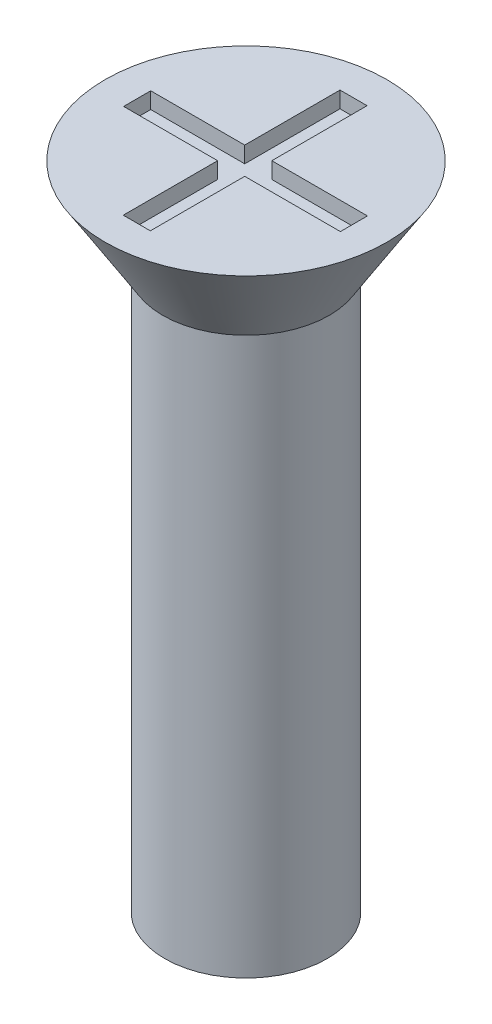
ISO-10303-21;
HEADER;
FILE_DESCRIPTION(('STEP AP214'),'2;1');
FILE_NAME('part.step','',(''),(''),'','','');
FILE_SCHEMA(('AUTOMOTIVE_DESIGN { 1 0 10303 214 1 1 1 1 }'));
ENDSEC;
DATA;
#1=APPLICATION_CONTEXT('core data for automotive mechanical design processes');
#2=APPLICATION_PROTOCOL_DEFINITION('international standard','automotive_design',2000,#1);
#3=PRODUCT_CONTEXT('',#1,'mechanical');
#4=PRODUCT('Part','Part','',(#3));
#5=PRODUCT_RELATED_PRODUCT_CATEGORY('part','',(#4));
#6=PRODUCT_DEFINITION_FORMATION('','',#4);
#7=PRODUCT_DEFINITION_CONTEXT('part definition',#1,'design');
#8=PRODUCT_DEFINITION('design','',#6,#7);
#9=PRODUCT_DEFINITION_SHAPE('','',#8);
#10=(LENGTH_UNIT() NAMED_UNIT(*) SI_UNIT(.MILLI.,.METRE.));
#11=(NAMED_UNIT(*) PLANE_ANGLE_UNIT() SI_UNIT($,.RADIAN.));
#12=(NAMED_UNIT(*) SI_UNIT($,.STERADIAN.) SOLID_ANGLE_UNIT());
#13=UNCERTAINTY_MEASURE_WITH_UNIT(LENGTH_MEASURE(1.E-05),#10,'distance_accuracy_value','');
#14=(GEOMETRIC_REPRESENTATION_CONTEXT(3) GLOBAL_UNCERTAINTY_ASSIGNED_CONTEXT((#13)) GLOBAL_UNIT_ASSIGNED_CONTEXT((#10,
#11,#12)) REPRESENTATION_CONTEXT('',''));
#15=CARTESIAN_POINT('',(0.,0.,0.));
#16=DIRECTION('',(0.,0.,1.));
#17=DIRECTION('',(1.,0.,0.));
#18=AXIS2_PLACEMENT_3D('',#15,#16,#17);
#19=CARTESIAN_POINT('',(0.,12.,0.));
#20=DIRECTION('',(0.,1.,0.));
#21=DIRECTION('',(0.,0.,1.));
#22=AXIS2_PLACEMENT_3D('',#19,#20,#21);
#23=PLANE('',#22);
#24=CARTESIAN_POINT('',(0.,12.,0.));
#25=DIRECTION('',(0.,1.,0.));
#26=DIRECTION('',(0.,0.,1.));
#27=AXIS2_PLACEMENT_3D('',#24,#25,#26);
#28=CIRCLE('',#27,2.6);
#29=CARTESIAN_POINT('',(0.,12.,2.6));
#30=VERTEX_POINT('',#29);
#31=EDGE_CURVE('E192',#30,#30,#28,.T.);
#32=ORIENTED_EDGE('',*,*,#31,.T.);
#33=EDGE_LOOP('',(#32));
#34=FACE_BOUND('',#33,.T.);
#35=DIRECTION('',(1.,0.,0.));
#36=VECTOR('',#35,1.);
#37=CARTESIAN_POINT('',(0.,12.,-2.));
#38=LINE('',#37,#36);
#39=CARTESIAN_POINT('',(-0.265272843023468,12.,-2.));
#40=VERTEX_POINT('',#39);
#41=CARTESIAN_POINT('',(0.234727156976532,12.,-2.));
#42=VERTEX_POINT('',#41);
#43=EDGE_CURVE('E161',#40,#42,#38,.T.);
#44=ORIENTED_EDGE('',*,*,#43,.T.);
#45=DIRECTION('',(0.,0.,1.));
#46=VECTOR('',#45,1.);
#47=CARTESIAN_POINT('',(0.234727156976532,12.,0.));
#48=LINE('',#47,#46);
#49=CARTESIAN_POINT('',(0.234727156976532,12.,-0.241621514992573));
#50=VERTEX_POINT('',#49);
#51=EDGE_CURVE('E48',#42,#50,#48,.T.);
#52=ORIENTED_EDGE('',*,*,#51,.T.);
#53=DIRECTION('',(1.,0.,0.));
#54=VECTOR('',#53,1.);
#55=CARTESIAN_POINT('',(0.,12.,-0.241621514992573));
#56=LINE('',#55,#54);
#57=CARTESIAN_POINT('',(2.,12.,-0.241621514992573));
#58=VERTEX_POINT('',#57);
#59=EDGE_CURVE('E98',#50,#58,#56,.T.);
#60=ORIENTED_EDGE('',*,*,#59,.T.);
#61=DIRECTION('',(0.,0.,1.));
#62=VECTOR('',#61,1.);
#63=CARTESIAN_POINT('',(2.,12.,0.));
#64=LINE('',#63,#62);
#65=CARTESIAN_POINT('',(2.,12.,0.258378485007427));
#66=VERTEX_POINT('',#65);
#67=EDGE_CURVE('E186',#58,#66,#64,.T.);
#68=ORIENTED_EDGE('',*,*,#67,.T.);
#69=DIRECTION('',(1.,0.,0.));
#70=VECTOR('',#69,1.);
#71=CARTESIAN_POINT('',(0.,12.,0.258378485007427));
#72=LINE('',#71,#70);
#73=CARTESIAN_POINT('',(0.234727156976532,12.,0.258378485007427));
#74=VERTEX_POINT('',#73);
#75=EDGE_CURVE('E145',#74,#66,#72,.T.);
#76=ORIENTED_EDGE('',*,*,#75,.F.);
#77=DIRECTION('',(0.,0.,1.));
#78=VECTOR('',#77,1.);
#79=CARTESIAN_POINT('',(0.234727156976532,12.,0.));
#80=LINE('',#79,#78);
#81=CARTESIAN_POINT('',(0.234727156976533,12.,2.));
#82=VERTEX_POINT('',#81);
#83=EDGE_CURVE('E182',#74,#82,#80,.T.);
#84=ORIENTED_EDGE('',*,*,#83,.T.);
#85=DIRECTION('',(1.,0.,0.));
#86=VECTOR('',#85,1.);
#87=CARTESIAN_POINT('',(0.,12.,2.));
#88=LINE('',#87,#86);
#89=CARTESIAN_POINT('',(-0.265272843023467,12.,2.));
#90=VERTEX_POINT('',#89);
#91=EDGE_CURVE('E179',#90,#82,#88,.T.);
#92=ORIENTED_EDGE('',*,*,#91,.F.);
#93=DIRECTION('',(0.,0.,1.));
#94=VECTOR('',#93,1.);
#95=CARTESIAN_POINT('',(-0.265272843023468,12.,0.));
#96=LINE('',#95,#94);
#97=CARTESIAN_POINT('',(-0.265272843023468,12.,0.258378485007427));
#98=VERTEX_POINT('',#97);
#99=EDGE_CURVE('E176',#98,#90,#96,.T.);
#100=ORIENTED_EDGE('',*,*,#99,.F.);
#101=DIRECTION('',(1.,0.,0.));
#102=VECTOR('',#101,1.);
#103=CARTESIAN_POINT('',(0.,12.,0.258378485007427));
#104=LINE('',#103,#102);
#105=CARTESIAN_POINT('',(-2.,12.,0.258378485007427));
#106=VERTEX_POINT('',#105);
#107=EDGE_CURVE('E173',#106,#98,#104,.T.);
#108=ORIENTED_EDGE('',*,*,#107,.F.);
#109=DIRECTION('',(0.,0.,1.));
#110=VECTOR('',#109,1.);
#111=CARTESIAN_POINT('',(-2.,12.,0.));
#112=LINE('',#111,#110);
#113=CARTESIAN_POINT('',(-2.,12.,-0.241621514992573));
#114=VERTEX_POINT('',#113);
#115=EDGE_CURVE('E170',#114,#106,#112,.T.);
#116=ORIENTED_EDGE('',*,*,#115,.F.);
#117=DIRECTION('',(1.,0.,0.));
#118=VECTOR('',#117,1.);
#119=CARTESIAN_POINT('',(0.,12.,-0.241621514992573));
#120=LINE('',#119,#118);
#121=CARTESIAN_POINT('',(-0.265272843023468,12.,-0.241621514992573));
#122=VERTEX_POINT('',#121);
#123=EDGE_CURVE('E167',#114,#122,#120,.T.);
#124=ORIENTED_EDGE('',*,*,#123,.T.);
#125=DIRECTION('',(0.,0.,1.));
#126=VECTOR('',#125,1.);
#127=CARTESIAN_POINT('',(-0.265272843023468,12.,0.));
#128=LINE('',#127,#126);
#129=EDGE_CURVE('E164',#40,#122,#128,.T.);
#130=ORIENTED_EDGE('',*,*,#129,.F.);
#131=EDGE_LOOP('',(#44,#52,#60,#68,#76,#84,#92,#100,#108,#116,#124,#130));
#132=FACE_BOUND('',#131,.T.);
#133=ADVANCED_FACE('F33',(#34,#132),#23,.T.);
#134=CARTESIAN_POINT('',(0.,12.,0.));
#135=DIRECTION('',(0.,-1.,0.));
#136=DIRECTION('',(0.,0.,-1.));
#137=AXIS2_PLACEMENT_3D('',#134,#135,#136);
#138=CYLINDRICAL_SURFACE('',#137,1.5);
#139=CARTESIAN_POINT('',(0.,0.,0.));
#140=DIRECTION('',(0.,1.,0.));
#141=DIRECTION('',(0.,0.,1.));
#142=AXIS2_PLACEMENT_3D('',#139,#140,#141);
#143=CIRCLE('',#142,1.5);
#144=CARTESIAN_POINT('',(0.,0.,1.5));
#145=VERTEX_POINT('',#144);
#146=EDGE_CURVE('E41',#145,#145,#143,.T.);
#147=ORIENTED_EDGE('',*,*,#146,.T.);
#148=EDGE_LOOP('',(#147));
#149=FACE_BOUND('',#148,.T.);
#150=CARTESIAN_POINT('',(0.,10.3,0.));
#151=DIRECTION('',(0.,1.,0.));
#152=DIRECTION('',(0.,0.,1.));
#153=AXIS2_PLACEMENT_3D('',#150,#151,#152);
#154=CIRCLE('',#153,1.5);
#155=CARTESIAN_POINT('',(0.,10.3,1.5));
#156=VERTEX_POINT('',#155);
#157=EDGE_CURVE('E11',#156,#156,#154,.T.);
#158=ORIENTED_EDGE('',*,*,#157,.F.);
#159=EDGE_LOOP('',(#158));
#160=FACE_BOUND('',#159,.T.);
#161=ADVANCED_FACE('F35',(#149,#160),#138,.T.);
#162=CARTESIAN_POINT('',(0.,0.,0.));
#163=DIRECTION('',(0.,1.,0.));
#164=DIRECTION('',(0.,0.,1.));
#165=AXIS2_PLACEMENT_3D('',#162,#163,#164);
#166=PLANE('',#165);
#167=ORIENTED_EDGE('',*,*,#146,.F.);
#168=EDGE_LOOP('',(#167));
#169=FACE_BOUND('',#168,.T.);
#170=ADVANCED_FACE('F219',(#169),#166,.F.);
#171=CARTESIAN_POINT('',(0.,12.,0.));
#172=DIRECTION('',(0.,1.,0.));
#173=DIRECTION('',(0.,0.,1.));
#174=AXIS2_PLACEMENT_3D('',#171,#172,#173);
#175=CONICAL_SURFACE('',#174,2.6,0.558505360638187);
#176=CARTESIAN_POINT('',(0.,10.3,0.));
#177=DIRECTION('',(0.,1.,0.));
#178=DIRECTION('',(0.,0.,1.));
#179=AXIS2_PLACEMENT_3D('',#176,#177,#178);
#180=CIRCLE('',#179,1.53772210175414);
#181=CARTESIAN_POINT('',(0.,10.3,1.53772210175414));
#182=VERTEX_POINT('',#181);
#183=EDGE_CURVE('E212',#182,#182,#180,.T.);
#184=ORIENTED_EDGE('',*,*,#183,.T.);
#185=EDGE_LOOP('',(#184));
#186=FACE_BOUND('',#185,.T.);
#187=ORIENTED_EDGE('',*,*,#31,.F.);
#188=EDGE_LOOP('',(#187));
#189=FACE_BOUND('',#188,.T.);
#190=ADVANCED_FACE('F221',(#186,#189),#175,.T.);
#191=CARTESIAN_POINT('',(0.,10.3,0.));
#192=DIRECTION('',(0.,1.,0.));
#193=DIRECTION('',(0.,0.,1.));
#194=AXIS2_PLACEMENT_3D('',#191,#192,#193);
#195=PLANE('',#194);
#196=ORIENTED_EDGE('',*,*,#157,.T.);
#197=EDGE_LOOP('',(#196));
#198=FACE_BOUND('',#197,.T.);
#199=ORIENTED_EDGE('',*,*,#183,.F.);
#200=EDGE_LOOP('',(#199));
#201=FACE_BOUND('',#200,.T.);
#202=ADVANCED_FACE('F226',(#198,#201),#195,.F.);
#203=CARTESIAN_POINT('',(0.234727156976532,11.7,0.));
#204=DIRECTION('',(-1.,0.,0.));
#205=DIRECTION('',(0.,0.,1.));
#206=AXIS2_PLACEMENT_3D('',#203,#204,#205);
#207=PLANE('',#206);
#208=ORIENTED_EDGE('',*,*,#51,.F.);
#209=DIRECTION('',(0.,1.,0.));
#210=VECTOR('',#209,1.);
#211=CARTESIAN_POINT('',(0.234727156976532,11.7,-2.));
#212=LINE('',#211,#210);
#213=CARTESIAN_POINT('',(0.234727156976532,11.7,-2.));
#214=VERTEX_POINT('',#213);
#215=EDGE_CURVE('E159',#214,#42,#212,.T.);
#216=ORIENTED_EDGE('',*,*,#215,.F.);
#217=DIRECTION('',(0.,0.,1.));
#218=VECTOR('',#217,1.);
#219=CARTESIAN_POINT('',(0.234727156976532,11.7,0.));
#220=LINE('',#219,#218);
#221=CARTESIAN_POINT('',(0.234727156976532,11.7,-0.241621514992573));
#222=VERTEX_POINT('',#221);
#223=EDGE_CURVE('E189',#214,#222,#220,.T.);
#224=ORIENTED_EDGE('',*,*,#223,.T.);
#225=DIRECTION('',(0.,1.,0.));
#226=VECTOR('',#225,1.);
#227=CARTESIAN_POINT('',(0.234727156976532,11.7,-0.241621514992573));
#228=LINE('',#227,#226);
#229=EDGE_CURVE('E190',#222,#50,#228,.T.);
#230=ORIENTED_EDGE('',*,*,#229,.T.);
#231=EDGE_LOOP('',(#208,#216,#224,#230));
#232=FACE_BOUND('',#231,.T.);
#233=ADVANCED_FACE('F238',(#232),#207,.T.);
#234=CARTESIAN_POINT('',(0.,11.7,-0.241621514992573));
#235=DIRECTION('',(0.,0.,1.));
#236=DIRECTION('',(1.,0.,0.));
#237=AXIS2_PLACEMENT_3D('',#234,#235,#236);
#238=PLANE('',#237);
#239=ORIENTED_EDGE('',*,*,#59,.F.);
#240=ORIENTED_EDGE('',*,*,#229,.F.);
#241=DIRECTION('',(1.,0.,0.));
#242=VECTOR('',#241,1.);
#243=CARTESIAN_POINT('',(0.,11.7,-0.241621514992573));
#244=LINE('',#243,#242);
#245=CARTESIAN_POINT('',(2.,11.7,-0.241621514992573));
#246=VERTEX_POINT('',#245);
#247=EDGE_CURVE('E57',#222,#246,#244,.T.);
#248=ORIENTED_EDGE('',*,*,#247,.T.);
#249=DIRECTION('',(0.,1.,0.));
#250=VECTOR('',#249,1.);
#251=CARTESIAN_POINT('',(2.,11.7,-0.241621514992573));
#252=LINE('',#251,#250);
#253=EDGE_CURVE('E137',#246,#58,#252,.T.);
#254=ORIENTED_EDGE('',*,*,#253,.T.);
#255=EDGE_LOOP('',(#239,#240,#248,#254));
#256=FACE_BOUND('',#255,.T.);
#257=ADVANCED_FACE('F242',(#256),#238,.T.);
#258=CARTESIAN_POINT('',(2.,11.7,0.));
#259=DIRECTION('',(-1.,0.,0.));
#260=DIRECTION('',(0.,0.,1.));
#261=AXIS2_PLACEMENT_3D('',#258,#259,#260);
#262=PLANE('',#261);
#263=ORIENTED_EDGE('',*,*,#67,.F.);
#264=ORIENTED_EDGE('',*,*,#253,.F.);
#265=DIRECTION('',(0.,0.,1.));
#266=VECTOR('',#265,1.);
#267=CARTESIAN_POINT('',(2.,11.7,0.));
#268=LINE('',#267,#266);
#269=CARTESIAN_POINT('',(2.,11.7,0.258378485007427));
#270=VERTEX_POINT('',#269);
#271=EDGE_CURVE('E131',#246,#270,#268,.T.);
#272=ORIENTED_EDGE('',*,*,#271,.T.);
#273=DIRECTION('',(0.,1.,0.));
#274=VECTOR('',#273,1.);
#275=CARTESIAN_POINT('',(2.,11.7,0.258378485007427));
#276=LINE('',#275,#274);
#277=EDGE_CURVE('E135',#270,#66,#276,.T.);
#278=ORIENTED_EDGE('',*,*,#277,.T.);
#279=EDGE_LOOP('',(#263,#264,#272,#278));
#280=FACE_BOUND('',#279,.T.);
#281=ADVANCED_FACE('F134',(#280),#262,.T.);
#282=CARTESIAN_POINT('',(0.,11.7,0.258378485007427));
#283=DIRECTION('',(0.,0.,1.));
#284=DIRECTION('',(1.,0.,0.));
#285=AXIS2_PLACEMENT_3D('',#282,#283,#284);
#286=PLANE('',#285);
#287=ORIENTED_EDGE('',*,*,#75,.T.);
#288=ORIENTED_EDGE('',*,*,#277,.F.);
#289=DIRECTION('',(1.,0.,0.));
#290=VECTOR('',#289,1.);
#291=CARTESIAN_POINT('',(0.,11.7,0.258378485007427));
#292=LINE('',#291,#290);
#293=CARTESIAN_POINT('',(0.234727156976532,11.7,0.258378485007427));
#294=VERTEX_POINT('',#293);
#295=EDGE_CURVE('E139',#294,#270,#292,.T.);
#296=ORIENTED_EDGE('',*,*,#295,.F.);
#297=DIRECTION('',(0.,1.,0.));
#298=VECTOR('',#297,1.);
#299=CARTESIAN_POINT('',(0.234727156976532,11.7,0.258378485007427));
#300=LINE('',#299,#298);
#301=EDGE_CURVE('E147',#294,#74,#300,.T.);
#302=ORIENTED_EDGE('',*,*,#301,.T.);
#303=EDGE_LOOP('',(#287,#288,#296,#302));
#304=FACE_BOUND('',#303,.T.);
#305=ADVANCED_FACE('F143',(#304),#286,.F.);
#306=CARTESIAN_POINT('',(0.234727156976532,11.7,0.));
#307=DIRECTION('',(-1.,0.,0.));
#308=DIRECTION('',(0.,0.,1.));
#309=AXIS2_PLACEMENT_3D('',#306,#307,#308);
#310=PLANE('',#309);
#311=ORIENTED_EDGE('',*,*,#83,.F.);
#312=ORIENTED_EDGE('',*,*,#301,.F.);
#313=DIRECTION('',(0.,0.,1.));
#314=VECTOR('',#313,1.);
#315=CARTESIAN_POINT('',(0.234727156976532,11.7,0.));
#316=LINE('',#315,#314);
#317=CARTESIAN_POINT('',(0.234727156976533,11.7,2.));
#318=VERTEX_POINT('',#317);
#319=EDGE_CURVE('E152',#294,#318,#316,.T.);
#320=ORIENTED_EDGE('',*,*,#319,.T.);
#321=DIRECTION('',(0.,1.,0.));
#322=VECTOR('',#321,1.);
#323=CARTESIAN_POINT('',(0.234727156976533,11.7,2.));
#324=LINE('',#323,#322);
#325=EDGE_CURVE('E195',#318,#82,#324,.T.);
#326=ORIENTED_EDGE('',*,*,#325,.T.);
#327=EDGE_LOOP('',(#311,#312,#320,#326));
#328=FACE_BOUND('',#327,.T.);
#329=ADVANCED_FACE('F269',(#328),#310,.T.);
#330=CARTESIAN_POINT('',(0.,11.7,2.));
#331=DIRECTION('',(0.,0.,1.));
#332=DIRECTION('',(1.,0.,0.));
#333=AXIS2_PLACEMENT_3D('',#330,#331,#332);
#334=PLANE('',#333);
#335=ORIENTED_EDGE('',*,*,#91,.T.);
#336=ORIENTED_EDGE('',*,*,#325,.F.);
#337=DIRECTION('',(1.,0.,0.));
#338=VECTOR('',#337,1.);
#339=CARTESIAN_POINT('',(0.,11.7,2.));
#340=LINE('',#339,#338);
#341=CARTESIAN_POINT('',(-0.265272843023467,11.7,2.));
#342=VERTEX_POINT('',#341);
#343=EDGE_CURVE('E154',#342,#318,#340,.T.);
#344=ORIENTED_EDGE('',*,*,#343,.F.);
#345=DIRECTION('',(0.,1.,0.));
#346=VECTOR('',#345,1.);
#347=CARTESIAN_POINT('',(-0.265272843023467,11.7,2.));
#348=LINE('',#347,#346);
#349=EDGE_CURVE('E197',#342,#90,#348,.T.);
#350=ORIENTED_EDGE('',*,*,#349,.T.);
#351=EDGE_LOOP('',(#335,#336,#344,#350));
#352=FACE_BOUND('',#351,.T.);
#353=ADVANCED_FACE('F265',(#352),#334,.F.);
#354=CARTESIAN_POINT('',(-0.265272843023468,11.7,0.));
#355=DIRECTION('',(-1.,0.,0.));
#356=DIRECTION('',(0.,0.,1.));
#357=AXIS2_PLACEMENT_3D('',#354,#355,#356);
#358=PLANE('',#357);
#359=ORIENTED_EDGE('',*,*,#99,.T.);
#360=ORIENTED_EDGE('',*,*,#349,.F.);
#361=DIRECTION('',(0.,0.,1.));
#362=VECTOR('',#361,1.);
#363=CARTESIAN_POINT('',(-0.265272843023468,11.7,0.));
#364=LINE('',#363,#362);
#365=CARTESIAN_POINT('',(-0.265272843023468,11.7,0.258378485007427));
#366=VERTEX_POINT('',#365);
#367=EDGE_CURVE('E417',#366,#342,#364,.T.);
#368=ORIENTED_EDGE('',*,*,#367,.F.);
#369=DIRECTION('',(0.,1.,0.));
#370=VECTOR('',#369,1.);
#371=CARTESIAN_POINT('',(-0.265272843023468,11.7,0.258378485007427));
#372=LINE('',#371,#370);
#373=EDGE_CURVE('E199',#366,#98,#372,.T.);
#374=ORIENTED_EDGE('',*,*,#373,.T.);
#375=EDGE_LOOP('',(#359,#360,#368,#374));
#376=FACE_BOUND('',#375,.T.);
#377=ADVANCED_FACE('F261',(#376),#358,.F.);
#378=CARTESIAN_POINT('',(0.,11.7,0.258378485007427));
#379=DIRECTION('',(0.,0.,1.));
#380=DIRECTION('',(1.,0.,0.));
#381=AXIS2_PLACEMENT_3D('',#378,#379,#380);
#382=PLANE('',#381);
#383=ORIENTED_EDGE('',*,*,#107,.T.);
#384=ORIENTED_EDGE('',*,*,#373,.F.);
#385=DIRECTION('',(1.,0.,0.));
#386=VECTOR('',#385,1.);
#387=CARTESIAN_POINT('',(0.,11.7,0.258378485007427));
#388=LINE('',#387,#386);
#389=CARTESIAN_POINT('',(-2.,11.7,0.258378485007427));
#390=VERTEX_POINT('',#389);
#391=EDGE_CURVE('E414',#390,#366,#388,.T.);
#392=ORIENTED_EDGE('',*,*,#391,.F.);
#393=DIRECTION('',(0.,1.,0.));
#394=VECTOR('',#393,1.);
#395=CARTESIAN_POINT('',(-2.,11.7,0.258378485007427));
#396=LINE('',#395,#394);
#397=EDGE_CURVE('E201',#390,#106,#396,.T.);
#398=ORIENTED_EDGE('',*,*,#397,.T.);
#399=EDGE_LOOP('',(#383,#384,#392,#398));
#400=FACE_BOUND('',#399,.T.);
#401=ADVANCED_FACE('F257',(#400),#382,.F.);
#402=CARTESIAN_POINT('',(-2.,11.7,0.));
#403=DIRECTION('',(-1.,0.,0.));
#404=DIRECTION('',(0.,0.,1.));
#405=AXIS2_PLACEMENT_3D('',#402,#403,#404);
#406=PLANE('',#405);
#407=ORIENTED_EDGE('',*,*,#115,.T.);
#408=ORIENTED_EDGE('',*,*,#397,.F.);
#409=DIRECTION('',(0.,0.,1.));
#410=VECTOR('',#409,1.);
#411=CARTESIAN_POINT('',(-2.,11.7,0.));
#412=LINE('',#411,#410);
#413=CARTESIAN_POINT('',(-2.,11.7,-0.241621514992573));
#414=VERTEX_POINT('',#413);
#415=EDGE_CURVE('E411',#414,#390,#412,.T.);
#416=ORIENTED_EDGE('',*,*,#415,.F.);
#417=DIRECTION('',(0.,1.,0.));
#418=VECTOR('',#417,1.);
#419=CARTESIAN_POINT('',(-2.,11.7,-0.241621514992573));
#420=LINE('',#419,#418);
#421=EDGE_CURVE('E203',#414,#114,#420,.T.);
#422=ORIENTED_EDGE('',*,*,#421,.T.);
#423=EDGE_LOOP('',(#407,#408,#416,#422));
#424=FACE_BOUND('',#423,.T.);
#425=ADVANCED_FACE('F253',(#424),#406,.F.);
#426=CARTESIAN_POINT('',(0.,11.7,-0.241621514992573));
#427=DIRECTION('',(0.,0.,1.));
#428=DIRECTION('',(1.,0.,0.));
#429=AXIS2_PLACEMENT_3D('',#426,#427,#428);
#430=PLANE('',#429);
#431=ORIENTED_EDGE('',*,*,#123,.F.);
#432=ORIENTED_EDGE('',*,*,#421,.F.);
#433=DIRECTION('',(1.,0.,0.));
#434=VECTOR('',#433,1.);
#435=CARTESIAN_POINT('',(0.,11.7,-0.241621514992573));
#436=LINE('',#435,#434);
#437=CARTESIAN_POINT('',(-0.265272843023468,11.7,-0.241621514992573));
#438=VERTEX_POINT('',#437);
#439=EDGE_CURVE('E409',#414,#438,#436,.T.);
#440=ORIENTED_EDGE('',*,*,#439,.T.);
#441=DIRECTION('',(0.,1.,0.));
#442=VECTOR('',#441,1.);
#443=CARTESIAN_POINT('',(-0.265272843023468,11.7,-0.241621514992573));
#444=LINE('',#443,#442);
#445=EDGE_CURVE('E205',#438,#122,#444,.T.);
#446=ORIENTED_EDGE('',*,*,#445,.T.);
#447=EDGE_LOOP('',(#431,#432,#440,#446));
#448=FACE_BOUND('',#447,.T.);
#449=ADVANCED_FACE('F249',(#448),#430,.T.);
#450=CARTESIAN_POINT('',(-0.265272843023468,11.7,0.));
#451=DIRECTION('',(-1.,0.,0.));
#452=DIRECTION('',(0.,0.,1.));
#453=AXIS2_PLACEMENT_3D('',#450,#451,#452);
#454=PLANE('',#453);
#455=ORIENTED_EDGE('',*,*,#129,.T.);
#456=ORIENTED_EDGE('',*,*,#445,.F.);
#457=DIRECTION('',(0.,0.,1.));
#458=VECTOR('',#457,1.);
#459=CARTESIAN_POINT('',(-0.265272843023468,11.7,0.));
#460=LINE('',#459,#458);
#461=CARTESIAN_POINT('',(-0.265272843023468,11.7,-2.));
#462=VERTEX_POINT('',#461);
#463=EDGE_CURVE('E405',#462,#438,#460,.T.);
#464=ORIENTED_EDGE('',*,*,#463,.F.);
#465=DIRECTION('',(0.,1.,0.));
#466=VECTOR('',#465,1.);
#467=CARTESIAN_POINT('',(-0.265272843023468,11.7,-2.));
#468=LINE('',#467,#466);
#469=EDGE_CURVE('E207',#462,#40,#468,.T.);
#470=ORIENTED_EDGE('',*,*,#469,.T.);
#471=EDGE_LOOP('',(#455,#456,#464,#470));
#472=FACE_BOUND('',#471,.T.);
#473=ADVANCED_FACE('F246',(#472),#454,.F.);
#474=CARTESIAN_POINT('',(0.,11.7,-2.));
#475=DIRECTION('',(0.,0.,1.));
#476=DIRECTION('',(1.,0.,0.));
#477=AXIS2_PLACEMENT_3D('',#474,#475,#476);
#478=PLANE('',#477);
#479=ORIENTED_EDGE('',*,*,#43,.F.);
#480=ORIENTED_EDGE('',*,*,#469,.F.);
#481=DIRECTION('',(1.,0.,0.));
#482=VECTOR('',#481,1.);
#483=CARTESIAN_POINT('',(0.,11.7,-2.));
#484=LINE('',#483,#482);
#485=EDGE_CURVE('E105',#462,#214,#484,.T.);
#486=ORIENTED_EDGE('',*,*,#485,.T.);
#487=ORIENTED_EDGE('',*,*,#215,.T.);
#488=EDGE_LOOP('',(#479,#480,#486,#487));
#489=FACE_BOUND('',#488,.T.);
#490=ADVANCED_FACE('F243',(#489),#478,.T.);
#491=CARTESIAN_POINT('',(0.,11.7,0.));
#492=DIRECTION('',(0.,1.,0.));
#493=DIRECTION('',(0.,0.,1.));
#494=AXIS2_PLACEMENT_3D('',#491,#492,#493);
#495=PLANE('',#494);
#496=ORIENTED_EDGE('',*,*,#223,.F.);
#497=ORIENTED_EDGE('',*,*,#485,.F.);
#498=ORIENTED_EDGE('',*,*,#463,.T.);
#499=ORIENTED_EDGE('',*,*,#439,.F.);
#500=ORIENTED_EDGE('',*,*,#415,.T.);
#501=ORIENTED_EDGE('',*,*,#391,.T.);
#502=ORIENTED_EDGE('',*,*,#367,.T.);
#503=ORIENTED_EDGE('',*,*,#343,.T.);
#504=ORIENTED_EDGE('',*,*,#319,.F.);
#505=ORIENTED_EDGE('',*,*,#295,.T.);
#506=ORIENTED_EDGE('',*,*,#271,.F.);
#507=ORIENTED_EDGE('',*,*,#247,.F.);
#508=EDGE_LOOP('',(#496,#497,#498,#499,#500,#501,#502,#503,#504,#505,#506,#507));
#509=FACE_BOUND('',#508,.T.);
#510=ADVANCED_FACE('F150',(#509),#495,.T.);
#511=CLOSED_SHELL('',(#133,#161,#170,#190,#202,#233,#257,#281,#305,#329,#353,#377,#401,#425,
#449,#473,#490,#510));
#512=MANIFOLD_SOLID_BREP('B2',#511);
#513=ADVANCED_BREP_SHAPE_REPRESENTATION('',(#18,#512),#14);
#514=SHAPE_DEFINITION_REPRESENTATION(#9,#513);
ENDSEC;
END-ISO-10303-21;
